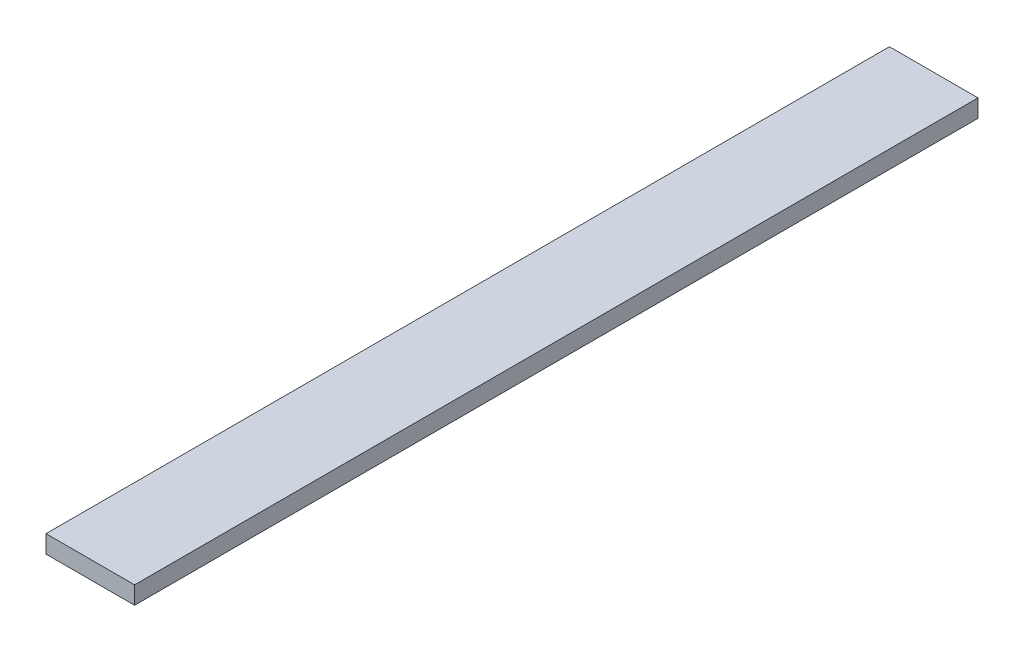
ISO-10303-21;
HEADER;
FILE_DESCRIPTION(('STEP AP214'),'2;1');
FILE_NAME('part.step','',(''),(''),'','','');
FILE_SCHEMA(('AUTOMOTIVE_DESIGN { 1 0 10303 214 1 1 1 1 }'));
ENDSEC;
DATA;
#1=APPLICATION_CONTEXT('core data for automotive mechanical design processes');
#2=APPLICATION_PROTOCOL_DEFINITION('international standard','automotive_design',2000,#1);
#3=PRODUCT_CONTEXT('',#1,'mechanical');
#4=PRODUCT('Part','Part','',(#3));
#5=PRODUCT_RELATED_PRODUCT_CATEGORY('part','',(#4));
#6=PRODUCT_DEFINITION_FORMATION('','',#4);
#7=PRODUCT_DEFINITION_CONTEXT('part definition',#1,'design');
#8=PRODUCT_DEFINITION('design','',#6,#7);
#9=PRODUCT_DEFINITION_SHAPE('','',#8);
#10=(LENGTH_UNIT() NAMED_UNIT(*) SI_UNIT(.MILLI.,.METRE.));
#11=(NAMED_UNIT(*) PLANE_ANGLE_UNIT() SI_UNIT($,.RADIAN.));
#12=(NAMED_UNIT(*) SI_UNIT($,.STERADIAN.) SOLID_ANGLE_UNIT());
#13=UNCERTAINTY_MEASURE_WITH_UNIT(LENGTH_MEASURE(1.E-05),#10,'distance_accuracy_value','');
#14=(GEOMETRIC_REPRESENTATION_CONTEXT(3) GLOBAL_UNCERTAINTY_ASSIGNED_CONTEXT((#13)) GLOBAL_UNIT_ASSIGNED_CONTEXT((#10,
#11,#12)) REPRESENTATION_CONTEXT('',''));
#15=CARTESIAN_POINT('',(0.,0.,0.));
#16=DIRECTION('',(0.,0.,1.));
#17=DIRECTION('',(1.,0.,0.));
#18=AXIS2_PLACEMENT_3D('',#15,#16,#17);
#19=CARTESIAN_POINT('',(0.,1.42999999999,0.));
#20=DIRECTION('',(0.,-1.,0.));
#21=DIRECTION('',(1.,0.,0.));
#22=AXIS2_PLACEMENT_3D('',#19,#20,#21);
#23=PLANE('',#22);
#24=DIRECTION('',(1.,0.,0.));
#25=VECTOR('',#24,1.);
#26=CARTESIAN_POINT('',(0.,1.42999999999,2.575));
#27=LINE('',#26,#25);
#28=CARTESIAN_POINT('',(-2.625,1.42999999999,2.575));
#29=VERTEX_POINT('',#28);
#30=CARTESIAN_POINT('',(-2.875,1.42999999999,2.575));
#31=VERTEX_POINT('',#30);
#32=EDGE_CURVE('E19',#29,#31,#27,.F.);
#33=ORIENTED_EDGE('',*,*,#32,.F.);
#34=DIRECTION('',(0.,0.,1.));
#35=VECTOR('',#34,1.);
#36=CARTESIAN_POINT('',(-2.625,1.42999999999,0.195));
#37=LINE('',#36,#35);
#38=CARTESIAN_POINT('',(-2.625,1.42999999999,0.195));
#39=VERTEX_POINT('',#38);
#40=EDGE_CURVE('E68',#29,#39,#37,.F.);
#41=ORIENTED_EDGE('',*,*,#40,.T.);
#42=DIRECTION('',(1.,0.,0.));
#43=VECTOR('',#42,1.);
#44=CARTESIAN_POINT('',(-2.875,1.42999999999,0.195));
#45=LINE('',#44,#43);
#46=CARTESIAN_POINT('',(-2.875,1.42999999999,0.195));
#47=VERTEX_POINT('',#46);
#48=EDGE_CURVE('E55',#39,#47,#45,.F.);
#49=ORIENTED_EDGE('',*,*,#48,.T.);
#50=DIRECTION('',(0.,0.,1.));
#51=VECTOR('',#50,1.);
#52=CARTESIAN_POINT('',(-2.875,1.42999999999,0.195));
#53=LINE('',#52,#51);
#54=EDGE_CURVE('E61',#47,#31,#53,.T.);
#55=ORIENTED_EDGE('',*,*,#54,.T.);
#56=EDGE_LOOP('',(#33,#41,#49,#55));
#57=FACE_BOUND('',#56,.T.);
#58=ADVANCED_FACE('F16',(#57),#23,.F.);
#59=CARTESIAN_POINT('',(-2.875,1.37999999999,0.195));
#60=DIRECTION('',(1.,0.,0.));
#61=DIRECTION('',(0.,1.,0.));
#62=AXIS2_PLACEMENT_3D('',#59,#60,#61);
#63=PLANE('',#62);
#64=DIRECTION('',(0.,1.,0.));
#65=VECTOR('',#64,1.);
#66=CARTESIAN_POINT('',(-2.875,1.37999999999,0.195));
#67=LINE('',#66,#65);
#68=CARTESIAN_POINT('',(-2.875,1.37999999999,0.195));
#69=VERTEX_POINT('',#68);
#70=EDGE_CURVE('E63',#47,#69,#67,.F.);
#71=ORIENTED_EDGE('',*,*,#70,.T.);
#72=DIRECTION('',(0.,0.,1.));
#73=VECTOR('',#72,1.);
#74=CARTESIAN_POINT('',(-2.875,1.37999999999,0.));
#75=LINE('',#74,#73);
#76=CARTESIAN_POINT('',(-2.875,1.37999999999,2.575));
#77=VERTEX_POINT('',#76);
#78=EDGE_CURVE('E82',#77,#69,#75,.F.);
#79=ORIENTED_EDGE('',*,*,#78,.F.);
#80=DIRECTION('',(0.,1.,0.));
#81=VECTOR('',#80,1.);
#82=CARTESIAN_POINT('',(-2.875,1.37999999999,2.575));
#83=LINE('',#82,#81);
#84=EDGE_CURVE('E66',#77,#31,#83,.T.);
#85=ORIENTED_EDGE('',*,*,#84,.T.);
#86=ORIENTED_EDGE('',*,*,#54,.F.);
#87=EDGE_LOOP('',(#71,#79,#85,#86));
#88=FACE_BOUND('',#87,.T.);
#89=ADVANCED_FACE('F62',(#88),#63,.F.);
#90=CARTESIAN_POINT('',(-2.875,1.37999999999,0.195));
#91=DIRECTION('',(0.,0.,1.));
#92=DIRECTION('',(1.,0.,0.));
#93=AXIS2_PLACEMENT_3D('',#90,#91,#92);
#94=PLANE('',#93);
#95=DIRECTION('',(0.,-1.,0.));
#96=VECTOR('',#95,1.);
#97=CARTESIAN_POINT('',(-2.625,1.37999999999,0.195));
#98=LINE('',#97,#96);
#99=CARTESIAN_POINT('',(-2.625,1.37999999999,0.195));
#100=VERTEX_POINT('',#99);
#101=EDGE_CURVE('E70',#39,#100,#98,.T.);
#102=ORIENTED_EDGE('',*,*,#101,.T.);
#103=DIRECTION('',(1.,0.,0.));
#104=VECTOR('',#103,1.);
#105=CARTESIAN_POINT('',(0.,1.37999999999,0.195));
#106=LINE('',#105,#104);
#107=EDGE_CURVE('E74',#69,#100,#106,.T.);
#108=ORIENTED_EDGE('',*,*,#107,.F.);
#109=ORIENTED_EDGE('',*,*,#70,.F.);
#110=ORIENTED_EDGE('',*,*,#48,.F.);
#111=EDGE_LOOP('',(#102,#108,#109,#110));
#112=FACE_BOUND('',#111,.T.);
#113=ADVANCED_FACE('F72',(#112),#94,.F.);
#114=CARTESIAN_POINT('',(-2.625,1.37999999999,0.195));
#115=DIRECTION('',(-1.,0.,0.));
#116=DIRECTION('',(0.,-1.,0.));
#117=AXIS2_PLACEMENT_3D('',#114,#115,#116);
#118=PLANE('',#117);
#119=DIRECTION('',(0.,1.,0.));
#120=VECTOR('',#119,1.);
#121=CARTESIAN_POINT('',(-2.625,1.37999999999,2.575));
#122=LINE('',#121,#120);
#123=CARTESIAN_POINT('',(-2.625,1.37999999999,2.575));
#124=VERTEX_POINT('',#123);
#125=EDGE_CURVE('E34',#29,#124,#122,.F.);
#126=ORIENTED_EDGE('',*,*,#125,.T.);
#127=DIRECTION('',(0.,0.,1.));
#128=VECTOR('',#127,1.);
#129=CARTESIAN_POINT('',(-2.625,1.37999999999,0.));
#130=LINE('',#129,#128);
#131=EDGE_CURVE('E25',#100,#124,#130,.T.);
#132=ORIENTED_EDGE('',*,*,#131,.F.);
#133=ORIENTED_EDGE('',*,*,#101,.F.);
#134=ORIENTED_EDGE('',*,*,#40,.F.);
#135=EDGE_LOOP('',(#126,#132,#133,#134));
#136=FACE_BOUND('',#135,.T.);
#137=ADVANCED_FACE('F88',(#136),#118,.F.);
#138=CARTESIAN_POINT('',(-2.875,1.37999999999,2.575));
#139=DIRECTION('',(0.,0.,-1.));
#140=DIRECTION('',(-1.,0.,0.));
#141=AXIS2_PLACEMENT_3D('',#138,#139,#140);
#142=PLANE('',#141);
#143=ORIENTED_EDGE('',*,*,#84,.F.);
#144=DIRECTION('',(1.,0.,0.));
#145=VECTOR('',#144,1.);
#146=CARTESIAN_POINT('',(0.,1.37999999999,2.575));
#147=LINE('',#146,#145);
#148=EDGE_CURVE('E11',#124,#77,#147,.F.);
#149=ORIENTED_EDGE('',*,*,#148,.F.);
#150=ORIENTED_EDGE('',*,*,#125,.F.);
#151=ORIENTED_EDGE('',*,*,#32,.T.);
#152=EDGE_LOOP('',(#143,#149,#150,#151));
#153=FACE_BOUND('',#152,.T.);
#154=ADVANCED_FACE('F90',(#153),#142,.F.);
#155=CARTESIAN_POINT('',(0.,1.37999999999,0.));
#156=DIRECTION('',(0.,-1.,0.));
#157=DIRECTION('',(1.,0.,0.));
#158=AXIS2_PLACEMENT_3D('',#155,#156,#157);
#159=PLANE('',#158);
#160=ORIENTED_EDGE('',*,*,#131,.T.);
#161=ORIENTED_EDGE('',*,*,#148,.T.);
#162=ORIENTED_EDGE('',*,*,#78,.T.);
#163=ORIENTED_EDGE('',*,*,#107,.T.);
#164=EDGE_LOOP('',(#160,#161,#162,#163));
#165=FACE_BOUND('',#164,.T.);
#166=ADVANCED_FACE('F87',(#165),#159,.T.);
#167=CLOSED_SHELL('',(#58,#89,#113,#137,#154,#166));
#168=MANIFOLD_SOLID_BREP('B1',#167);
#169=ADVANCED_BREP_SHAPE_REPRESENTATION('',(#18,#168),#14);
#170=SHAPE_DEFINITION_REPRESENTATION(#9,#169);
ENDSEC;
END-ISO-10303-21;
